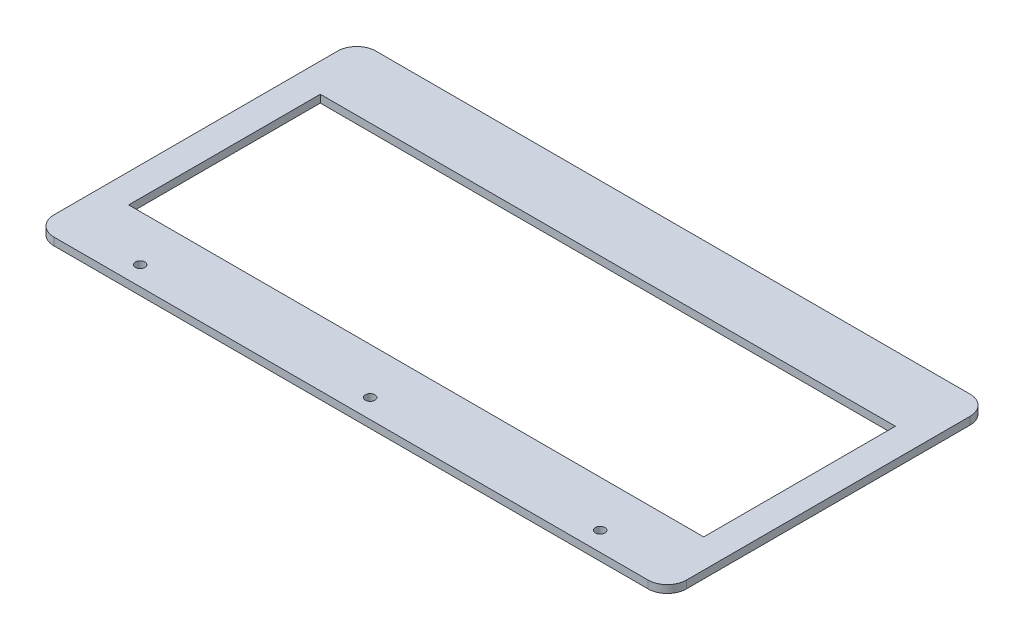
ISO-10303-21;
HEADER;
FILE_DESCRIPTION(('STEP AP214'),'2;1');
FILE_NAME('part.step','',(''),(''),'','','');
FILE_SCHEMA(('AUTOMOTIVE_DESIGN { 1 0 10303 214 1 1 1 1 }'));
ENDSEC;
DATA;
#1=APPLICATION_CONTEXT('core data for automotive mechanical design processes');
#2=APPLICATION_PROTOCOL_DEFINITION('international standard','automotive_design',2000,#1);
#3=PRODUCT_CONTEXT('',#1,'mechanical');
#4=PRODUCT('Part','Part','',(#3));
#5=PRODUCT_RELATED_PRODUCT_CATEGORY('part','',(#4));
#6=PRODUCT_DEFINITION_FORMATION('','',#4);
#7=PRODUCT_DEFINITION_CONTEXT('part definition',#1,'design');
#8=PRODUCT_DEFINITION('design','',#6,#7);
#9=PRODUCT_DEFINITION_SHAPE('','',#8);
#10=(LENGTH_UNIT() NAMED_UNIT(*) SI_UNIT(.MILLI.,.METRE.));
#11=(NAMED_UNIT(*) PLANE_ANGLE_UNIT() SI_UNIT($,.RADIAN.));
#12=(NAMED_UNIT(*) SI_UNIT($,.STERADIAN.) SOLID_ANGLE_UNIT());
#13=UNCERTAINTY_MEASURE_WITH_UNIT(LENGTH_MEASURE(1.E-05),#10,'distance_accuracy_value','');
#14=(GEOMETRIC_REPRESENTATION_CONTEXT(3) GLOBAL_UNCERTAINTY_ASSIGNED_CONTEXT((#13)) GLOBAL_UNIT_ASSIGNED_CONTEXT((#10,
#11,#12)) REPRESENTATION_CONTEXT('',''));
#15=CARTESIAN_POINT('',(0.,0.,0.));
#16=DIRECTION('',(0.,0.,1.));
#17=DIRECTION('',(1.,0.,0.));
#18=AXIS2_PLACEMENT_3D('',#15,#16,#17);
#19=CARTESIAN_POINT('',(-150.,-357.991093751232,-164.25));
#20=DIRECTION('',(0.,0.,-1.));
#21=DIRECTION('',(-1.,0.,0.));
#22=AXIS2_PLACEMENT_3D('',#19,#20,#21);
#23=PLANE('',#22);
#24=DIRECTION('',(0.,1.,0.));
#25=VECTOR('',#24,1.);
#26=CARTESIAN_POINT('',(150.,-357.991093751232,-164.25));
#27=LINE('',#26,#25);
#28=CARTESIAN_POINT('',(150.,-361.991093751232,-164.25));
#29=VERTEX_POINT('',#28);
#30=CARTESIAN_POINT('',(150.,-357.991093751232,-164.25));
#31=VERTEX_POINT('',#30);
#32=EDGE_CURVE('E11',#29,#31,#27,.T.);
#33=ORIENTED_EDGE('',*,*,#32,.F.);
#34=DIRECTION('',(1.,0.,0.));
#35=VECTOR('',#34,1.);
#36=CARTESIAN_POINT('',(0.,-361.991093751232,-164.25));
#37=LINE('',#36,#35);
#38=CARTESIAN_POINT('',(-150.,-361.991093751232,-164.25));
#39=VERTEX_POINT('',#38);
#40=EDGE_CURVE('E116',#29,#39,#37,.F.);
#41=ORIENTED_EDGE('',*,*,#40,.T.);
#42=DIRECTION('',(0.,1.,0.));
#43=VECTOR('',#42,1.);
#44=CARTESIAN_POINT('',(-150.,-357.991093751232,-164.25));
#45=LINE('',#44,#43);
#46=CARTESIAN_POINT('',(-150.,-357.991093751232,-164.25));
#47=VERTEX_POINT('',#46);
#48=EDGE_CURVE('E47',#39,#47,#45,.T.);
#49=ORIENTED_EDGE('',*,*,#48,.T.);
#50=DIRECTION('',(-1.,0.,0.));
#51=VECTOR('',#50,1.);
#52=CARTESIAN_POINT('',(-150.,-357.991093751232,-164.25));
#53=LINE('',#52,#51);
#54=EDGE_CURVE('E158',#31,#47,#53,.T.);
#55=ORIENTED_EDGE('',*,*,#54,.F.);
#56=EDGE_LOOP('',(#33,#41,#49,#55));
#57=FACE_BOUND('',#56,.T.);
#58=ADVANCED_FACE('F37',(#57),#23,.T.);
#59=CARTESIAN_POINT('',(-150.,-357.991093751232,-164.25));
#60=DIRECTION('',(1.,0.,0.));
#61=DIRECTION('',(0.,0.,-1.));
#62=AXIS2_PLACEMENT_3D('',#59,#60,#61);
#63=PLANE('',#62);
#64=ORIENTED_EDGE('',*,*,#48,.F.);
#65=DIRECTION('',(0.,0.,1.));
#66=VECTOR('',#65,1.);
#67=CARTESIAN_POINT('',(-150.,-361.991093751232,0.));
#68=LINE('',#67,#66);
#69=CARTESIAN_POINT('',(-150.,-361.991093751232,-264.25));
#70=VERTEX_POINT('',#69);
#71=EDGE_CURVE('E128',#39,#70,#68,.F.);
#72=ORIENTED_EDGE('',*,*,#71,.T.);
#73=DIRECTION('',(0.,1.,0.));
#74=VECTOR('',#73,1.);
#75=CARTESIAN_POINT('',(-150.,-357.991093751232,-264.25));
#76=LINE('',#75,#74);
#77=CARTESIAN_POINT('',(-150.,-357.991093751232,-264.25));
#78=VERTEX_POINT('',#77);
#79=EDGE_CURVE('E55',#70,#78,#76,.T.);
#80=ORIENTED_EDGE('',*,*,#79,.T.);
#81=DIRECTION('',(0.,0.,-1.));
#82=VECTOR('',#81,1.);
#83=CARTESIAN_POINT('',(-150.,-357.991093751232,-164.25));
#84=LINE('',#83,#82);
#85=EDGE_CURVE('E155',#47,#78,#84,.T.);
#86=ORIENTED_EDGE('',*,*,#85,.F.);
#87=EDGE_LOOP('',(#64,#72,#80,#86));
#88=FACE_BOUND('',#87,.T.);
#89=ADVANCED_FACE('F163',(#88),#63,.T.);
#90=CARTESIAN_POINT('',(-150.,-357.991093751232,-264.25));
#91=DIRECTION('',(0.,0.,1.));
#92=DIRECTION('',(1.,0.,0.));
#93=AXIS2_PLACEMENT_3D('',#90,#91,#92);
#94=PLANE('',#93);
#95=ORIENTED_EDGE('',*,*,#79,.F.);
#96=DIRECTION('',(1.,0.,0.));
#97=VECTOR('',#96,1.);
#98=CARTESIAN_POINT('',(0.,-361.991093751232,-264.25));
#99=LINE('',#98,#97);
#100=CARTESIAN_POINT('',(150.,-361.991093751232,-264.25));
#101=VERTEX_POINT('',#100);
#102=EDGE_CURVE('E115',#70,#101,#99,.T.);
#103=ORIENTED_EDGE('',*,*,#102,.T.);
#104=DIRECTION('',(0.,1.,0.));
#105=VECTOR('',#104,1.);
#106=CARTESIAN_POINT('',(150.,-357.991093751232,-264.25));
#107=LINE('',#106,#105);
#108=CARTESIAN_POINT('',(150.,-357.991093751232,-264.25));
#109=VERTEX_POINT('',#108);
#110=EDGE_CURVE('E41',#101,#109,#107,.T.);
#111=ORIENTED_EDGE('',*,*,#110,.T.);
#112=DIRECTION('',(1.,0.,0.));
#113=VECTOR('',#112,1.);
#114=CARTESIAN_POINT('',(-150.,-357.991093751232,-264.25));
#115=LINE('',#114,#113);
#116=EDGE_CURVE('E255',#78,#109,#115,.T.);
#117=ORIENTED_EDGE('',*,*,#116,.F.);
#118=EDGE_LOOP('',(#95,#103,#111,#117));
#119=FACE_BOUND('',#118,.T.);
#120=ADVANCED_FACE('F118',(#119),#94,.T.);
#121=CARTESIAN_POINT('',(-165.,-357.991093751232,-298.25));
#122=DIRECTION('',(0.,0.,1.));
#123=DIRECTION('',(1.,0.,0.));
#124=AXIS2_PLACEMENT_3D('',#121,#122,#123);
#125=PLANE('',#124);
#126=DIRECTION('',(0.,1.,0.));
#127=VECTOR('',#126,1.);
#128=CARTESIAN_POINT('',(155.,-357.991093751232,-298.25));
#129=LINE('',#128,#127);
#130=CARTESIAN_POINT('',(155.,-361.991093751232,-298.25));
#131=VERTEX_POINT('',#130);
#132=CARTESIAN_POINT('',(155.,-357.991093751232,-298.25));
#133=VERTEX_POINT('',#132);
#134=EDGE_CURVE('E110',#131,#133,#129,.T.);
#135=ORIENTED_EDGE('',*,*,#134,.F.);
#136=DIRECTION('',(1.,0.,0.));
#137=VECTOR('',#136,1.);
#138=CARTESIAN_POINT('',(0.,-361.991093751232,-298.25));
#139=LINE('',#138,#137);
#140=CARTESIAN_POINT('',(-155.,-361.991093751232,-298.25));
#141=VERTEX_POINT('',#140);
#142=EDGE_CURVE('E189',#141,#131,#139,.T.);
#143=ORIENTED_EDGE('',*,*,#142,.F.);
#144=DIRECTION('',(0.,1.,0.));
#145=VECTOR('',#144,1.);
#146=CARTESIAN_POINT('',(-155.,-357.991093751232,-298.25));
#147=LINE('',#146,#145);
#148=CARTESIAN_POINT('',(-155.,-357.991093751232,-298.25));
#149=VERTEX_POINT('',#148);
#150=EDGE_CURVE('E148',#141,#149,#147,.T.);
#151=ORIENTED_EDGE('',*,*,#150,.T.);
#152=DIRECTION('',(1.,0.,0.));
#153=VECTOR('',#152,1.);
#154=CARTESIAN_POINT('',(-165.,-357.991093751232,-298.25));
#155=LINE('',#154,#153);
#156=EDGE_CURVE('E232',#149,#133,#155,.T.);
#157=ORIENTED_EDGE('',*,*,#156,.T.);
#158=EDGE_LOOP('',(#135,#143,#151,#157));
#159=FACE_BOUND('',#158,.T.);
#160=ADVANCED_FACE('F231',(#159),#125,.F.);
#161=CARTESIAN_POINT('',(-155.,-357.991093751232,-288.25));
#162=DIRECTION('',(0.,1.,0.));
#163=DIRECTION('',(0.,0.,1.));
#164=AXIS2_PLACEMENT_3D('',#161,#162,#163);
#165=CYLINDRICAL_SURFACE('',#164,10.);
#166=ORIENTED_EDGE('',*,*,#150,.F.);
#167=CARTESIAN_POINT('',(-155.,-361.991093751232,-288.25));
#168=DIRECTION('',(0.,1.,0.));
#169=DIRECTION('',(0.,0.,1.));
#170=AXIS2_PLACEMENT_3D('',#167,#168,#169);
#171=CIRCLE('',#170,10.);
#172=CARTESIAN_POINT('',(-165.,-361.991093751232,-288.25));
#173=VERTEX_POINT('',#172);
#174=EDGE_CURVE('E187',#141,#173,#171,.T.);
#175=ORIENTED_EDGE('',*,*,#174,.T.);
#176=DIRECTION('',(0.,1.,0.));
#177=VECTOR('',#176,1.);
#178=CARTESIAN_POINT('',(-165.,-357.991093751232,-288.25));
#179=LINE('',#178,#177);
#180=CARTESIAN_POINT('',(-165.,-357.991093751232,-288.25));
#181=VERTEX_POINT('',#180);
#182=EDGE_CURVE('E145',#173,#181,#179,.T.);
#183=ORIENTED_EDGE('',*,*,#182,.T.);
#184=CARTESIAN_POINT('',(-155.,-357.991093751232,-288.25));
#185=DIRECTION('',(0.,1.,0.));
#186=DIRECTION('',(0.,0.,1.));
#187=AXIS2_PLACEMENT_3D('',#184,#185,#186);
#188=CIRCLE('',#187,10.);
#189=EDGE_CURVE('E238',#149,#181,#188,.T.);
#190=ORIENTED_EDGE('',*,*,#189,.F.);
#191=EDGE_LOOP('',(#166,#175,#183,#190));
#192=FACE_BOUND('',#191,.T.);
#193=ADVANCED_FACE('F242',(#192),#165,.T.);
#194=CARTESIAN_POINT('',(-165.,-357.991093751232,-298.25));
#195=DIRECTION('',(1.,0.,0.));
#196=DIRECTION('',(0.,0.,-1.));
#197=AXIS2_PLACEMENT_3D('',#194,#195,#196);
#198=PLANE('',#197);
#199=ORIENTED_EDGE('',*,*,#182,.F.);
#200=DIRECTION('',(0.,0.,1.));
#201=VECTOR('',#200,1.);
#202=CARTESIAN_POINT('',(-165.,-361.991093751232,0.));
#203=LINE('',#202,#201);
#204=CARTESIAN_POINT('',(-165.,-361.991093751232,-140.25));
#205=VERTEX_POINT('',#204);
#206=EDGE_CURVE('E184',#205,#173,#203,.F.);
#207=ORIENTED_EDGE('',*,*,#206,.F.);
#208=DIRECTION('',(0.,1.,0.));
#209=VECTOR('',#208,1.);
#210=CARTESIAN_POINT('',(-165.,-357.991093751232,-140.25));
#211=LINE('',#210,#209);
#212=CARTESIAN_POINT('',(-165.,-357.991093751232,-140.25));
#213=VERTEX_POINT('',#212);
#214=EDGE_CURVE('E142',#205,#213,#211,.T.);
#215=ORIENTED_EDGE('',*,*,#214,.T.);
#216=DIRECTION('',(0.,0.,-1.));
#217=VECTOR('',#216,1.);
#218=CARTESIAN_POINT('',(-165.,-357.991093751232,-298.25));
#219=LINE('',#218,#217);
#220=EDGE_CURVE('E243',#213,#181,#219,.T.);
#221=ORIENTED_EDGE('',*,*,#220,.T.);
#222=EDGE_LOOP('',(#199,#207,#215,#221));
#223=FACE_BOUND('',#222,.T.);
#224=ADVANCED_FACE('F266',(#223),#198,.F.);
#225=CARTESIAN_POINT('',(-155.,-357.991093751232,-140.25));
#226=DIRECTION('',(0.,1.,0.));
#227=DIRECTION('',(0.,0.,1.));
#228=AXIS2_PLACEMENT_3D('',#225,#226,#227);
#229=CYLINDRICAL_SURFACE('',#228,10.);
#230=ORIENTED_EDGE('',*,*,#214,.F.);
#231=CARTESIAN_POINT('',(-155.,-361.991093751232,-140.25));
#232=DIRECTION('',(0.,1.,0.));
#233=DIRECTION('',(0.,0.,1.));
#234=AXIS2_PLACEMENT_3D('',#231,#232,#233);
#235=CIRCLE('',#234,10.);
#236=CARTESIAN_POINT('',(-155.,-361.991093751232,-130.25));
#237=VERTEX_POINT('',#236);
#238=EDGE_CURVE('E181',#205,#237,#235,.T.);
#239=ORIENTED_EDGE('',*,*,#238,.T.);
#240=DIRECTION('',(0.,1.,0.));
#241=VECTOR('',#240,1.);
#242=CARTESIAN_POINT('',(-155.,-357.991093751232,-130.25));
#243=LINE('',#242,#241);
#244=CARTESIAN_POINT('',(-155.,-357.991093751232,-130.25));
#245=VERTEX_POINT('',#244);
#246=EDGE_CURVE('E139',#237,#245,#243,.T.);
#247=ORIENTED_EDGE('',*,*,#246,.T.);
#248=CARTESIAN_POINT('',(-155.,-357.991093751232,-140.25));
#249=DIRECTION('',(0.,1.,0.));
#250=DIRECTION('',(0.,0.,1.));
#251=AXIS2_PLACEMENT_3D('',#248,#249,#250);
#252=CIRCLE('',#251,10.);
#253=EDGE_CURVE('E245',#213,#245,#252,.T.);
#254=ORIENTED_EDGE('',*,*,#253,.F.);
#255=EDGE_LOOP('',(#230,#239,#247,#254));
#256=FACE_BOUND('',#255,.T.);
#257=ADVANCED_FACE('F264',(#256),#229,.T.);
#258=CARTESIAN_POINT('',(-165.,-357.991093751232,-130.25));
#259=DIRECTION('',(0.,0.,-1.));
#260=DIRECTION('',(-1.,0.,0.));
#261=AXIS2_PLACEMENT_3D('',#258,#259,#260);
#262=PLANE('',#261);
#263=ORIENTED_EDGE('',*,*,#246,.F.);
#264=DIRECTION('',(1.,0.,0.));
#265=VECTOR('',#264,1.);
#266=CARTESIAN_POINT('',(0.,-361.991093751232,-130.25));
#267=LINE('',#266,#265);
#268=CARTESIAN_POINT('',(155.,-361.991093751232,-130.25));
#269=VERTEX_POINT('',#268);
#270=EDGE_CURVE('E122',#269,#237,#267,.F.);
#271=ORIENTED_EDGE('',*,*,#270,.F.);
#272=DIRECTION('',(0.,1.,0.));
#273=VECTOR('',#272,1.);
#274=CARTESIAN_POINT('',(155.,-357.991093751232,-130.25));
#275=LINE('',#274,#273);
#276=CARTESIAN_POINT('',(155.,-357.991093751232,-130.25));
#277=VERTEX_POINT('',#276);
#278=EDGE_CURVE('E135',#269,#277,#275,.T.);
#279=ORIENTED_EDGE('',*,*,#278,.T.);
#280=DIRECTION('',(-1.,0.,0.));
#281=VECTOR('',#280,1.);
#282=CARTESIAN_POINT('',(-165.,-357.991093751232,-130.25));
#283=LINE('',#282,#281);
#284=EDGE_CURVE('E251',#277,#245,#283,.T.);
#285=ORIENTED_EDGE('',*,*,#284,.T.);
#286=EDGE_LOOP('',(#263,#271,#279,#285));
#287=FACE_BOUND('',#286,.T.);
#288=ADVANCED_FACE('F259',(#287),#262,.F.);
#289=CARTESIAN_POINT('',(155.,-357.991093751232,-140.25));
#290=DIRECTION('',(0.,1.,0.));
#291=DIRECTION('',(0.,0.,1.));
#292=AXIS2_PLACEMENT_3D('',#289,#290,#291);
#293=CYLINDRICAL_SURFACE('',#292,10.);
#294=ORIENTED_EDGE('',*,*,#278,.F.);
#295=CARTESIAN_POINT('',(155.,-361.991093751232,-140.25));
#296=DIRECTION('',(0.,1.,0.));
#297=DIRECTION('',(0.,0.,1.));
#298=AXIS2_PLACEMENT_3D('',#295,#296,#297);
#299=CIRCLE('',#298,10.);
#300=CARTESIAN_POINT('',(165.,-361.991093751232,-140.25));
#301=VERTEX_POINT('',#300);
#302=EDGE_CURVE('E119',#269,#301,#299,.T.);
#303=ORIENTED_EDGE('',*,*,#302,.T.);
#304=DIRECTION('',(0.,1.,0.));
#305=VECTOR('',#304,1.);
#306=CARTESIAN_POINT('',(165.,-357.991093751232,-140.25));
#307=LINE('',#306,#305);
#308=CARTESIAN_POINT('',(165.,-357.991093751232,-140.25));
#309=VERTEX_POINT('',#308);
#310=EDGE_CURVE('E132',#301,#309,#307,.T.);
#311=ORIENTED_EDGE('',*,*,#310,.T.);
#312=CARTESIAN_POINT('',(155.,-357.991093751232,-140.25));
#313=DIRECTION('',(0.,1.,0.));
#314=DIRECTION('',(0.,0.,1.));
#315=AXIS2_PLACEMENT_3D('',#312,#313,#314);
#316=CIRCLE('',#315,10.);
#317=EDGE_CURVE('E214',#277,#309,#316,.T.);
#318=ORIENTED_EDGE('',*,*,#317,.F.);
#319=EDGE_LOOP('',(#294,#303,#311,#318));
#320=FACE_BOUND('',#319,.T.);
#321=ADVANCED_FACE('F212',(#320),#293,.T.);
#322=CARTESIAN_POINT('',(165.,-357.991093751232,-298.25));
#323=DIRECTION('',(-1.,0.,0.));
#324=DIRECTION('',(0.,0.,1.));
#325=AXIS2_PLACEMENT_3D('',#322,#323,#324);
#326=PLANE('',#325);
#327=ORIENTED_EDGE('',*,*,#310,.F.);
#328=DIRECTION('',(0.,0.,1.));
#329=VECTOR('',#328,1.);
#330=CARTESIAN_POINT('',(165.,-361.991093751232,0.));
#331=LINE('',#330,#329);
#332=CARTESIAN_POINT('',(165.,-361.991093751232,-288.25));
#333=VERTEX_POINT('',#332);
#334=EDGE_CURVE('E176',#333,#301,#331,.T.);
#335=ORIENTED_EDGE('',*,*,#334,.F.);
#336=DIRECTION('',(0.,1.,0.));
#337=VECTOR('',#336,1.);
#338=CARTESIAN_POINT('',(165.,-357.991093751232,-288.25));
#339=LINE('',#338,#337);
#340=CARTESIAN_POINT('',(165.,-357.991093751232,-288.25));
#341=VERTEX_POINT('',#340);
#342=EDGE_CURVE('E136',#333,#341,#339,.T.);
#343=ORIENTED_EDGE('',*,*,#342,.T.);
#344=DIRECTION('',(0.,0.,1.));
#345=VECTOR('',#344,1.);
#346=CARTESIAN_POINT('',(165.,-357.991093751232,-298.25));
#347=LINE('',#346,#345);
#348=EDGE_CURVE('E208',#341,#309,#347,.T.);
#349=ORIENTED_EDGE('',*,*,#348,.T.);
#350=EDGE_LOOP('',(#327,#335,#343,#349));
#351=FACE_BOUND('',#350,.T.);
#352=ADVANCED_FACE('F204',(#351),#326,.F.);
#353=CARTESIAN_POINT('',(-120.,-357.991093751232,-140.25));
#354=DIRECTION('',(0.,1.,0.));
#355=DIRECTION('',(0.,0.,1.));
#356=AXIS2_PLACEMENT_3D('',#353,#354,#355);
#357=CYLINDRICAL_SURFACE('',#356,2.49999999999999);
#358=CARTESIAN_POINT('',(-120.,-357.991093751232,-140.25));
#359=DIRECTION('',(0.,1.,0.));
#360=DIRECTION('',(0.,0.,1.));
#361=AXIS2_PLACEMENT_3D('',#358,#359,#360);
#362=CIRCLE('',#361,2.49999999999999);
#363=CARTESIAN_POINT('',(-120.,-357.991093751232,-137.75));
#364=VERTEX_POINT('',#363);
#365=EDGE_CURVE('E130',#364,#364,#362,.T.);
#366=ORIENTED_EDGE('',*,*,#365,.T.);
#367=EDGE_LOOP('',(#366));
#368=FACE_BOUND('',#367,.T.);
#369=CARTESIAN_POINT('',(-120.,-361.991093751232,-140.25));
#370=DIRECTION('',(0.,1.,0.));
#371=DIRECTION('',(0.,0.,1.));
#372=AXIS2_PLACEMENT_3D('',#369,#370,#371);
#373=CIRCLE('',#372,2.49999999999999);
#374=CARTESIAN_POINT('',(-120.,-361.991093751232,-137.75));
#375=VERTEX_POINT('',#374);
#376=EDGE_CURVE('E167',#375,#375,#373,.T.);
#377=ORIENTED_EDGE('',*,*,#376,.F.);
#378=EDGE_LOOP('',(#377));
#379=FACE_BOUND('',#378,.T.);
#380=ADVANCED_FACE('F335',(#368,#379),#357,.F.);
#381=CARTESIAN_POINT('',(0.,-357.991093751232,-140.25));
#382=DIRECTION('',(0.,1.,0.));
#383=DIRECTION('',(0.,0.,1.));
#384=AXIS2_PLACEMENT_3D('',#381,#382,#383);
#385=CYLINDRICAL_SURFACE('',#384,2.49999999999999);
#386=CARTESIAN_POINT('',(0.,-357.991093751232,-140.25));
#387=DIRECTION('',(0.,1.,0.));
#388=DIRECTION('',(0.,0.,1.));
#389=AXIS2_PLACEMENT_3D('',#386,#387,#388);
#390=CIRCLE('',#389,2.49999999999999);
#391=CARTESIAN_POINT('',(0.,-357.991093751232,-137.75));
#392=VERTEX_POINT('',#391);
#393=EDGE_CURVE('E494',#392,#392,#390,.T.);
#394=ORIENTED_EDGE('',*,*,#393,.T.);
#395=EDGE_LOOP('',(#394));
#396=FACE_BOUND('',#395,.T.);
#397=CARTESIAN_POINT('',(0.,-361.991093751232,-140.25));
#398=DIRECTION('',(0.,1.,0.));
#399=DIRECTION('',(0.,0.,1.));
#400=AXIS2_PLACEMENT_3D('',#397,#398,#399);
#401=CIRCLE('',#400,2.49999999999999);
#402=CARTESIAN_POINT('',(0.,-361.991093751232,-137.75));
#403=VERTEX_POINT('',#402);
#404=EDGE_CURVE('E170',#403,#403,#401,.T.);
#405=ORIENTED_EDGE('',*,*,#404,.F.);
#406=EDGE_LOOP('',(#405));
#407=FACE_BOUND('',#406,.T.);
#408=ADVANCED_FACE('F345',(#396,#407),#385,.F.);
#409=CARTESIAN_POINT('',(120.,-357.991093751232,-140.25));
#410=DIRECTION('',(0.,1.,0.));
#411=DIRECTION('',(0.,0.,1.));
#412=AXIS2_PLACEMENT_3D('',#409,#410,#411);
#413=CYLINDRICAL_SURFACE('',#412,2.49999999999999);
#414=CARTESIAN_POINT('',(120.,-357.991093751232,-140.25));
#415=DIRECTION('',(0.,1.,0.));
#416=DIRECTION('',(0.,0.,1.));
#417=AXIS2_PLACEMENT_3D('',#414,#415,#416);
#418=CIRCLE('',#417,2.49999999999999);
#419=CARTESIAN_POINT('',(120.,-357.991093751232,-137.75));
#420=VERTEX_POINT('',#419);
#421=EDGE_CURVE('E497',#420,#420,#418,.T.);
#422=ORIENTED_EDGE('',*,*,#421,.T.);
#423=EDGE_LOOP('',(#422));
#424=FACE_BOUND('',#423,.T.);
#425=CARTESIAN_POINT('',(120.,-361.991093751232,-140.25));
#426=DIRECTION('',(0.,1.,0.));
#427=DIRECTION('',(0.,0.,1.));
#428=AXIS2_PLACEMENT_3D('',#425,#426,#427);
#429=CIRCLE('',#428,2.49999999999999);
#430=CARTESIAN_POINT('',(120.,-361.991093751232,-137.75));
#431=VERTEX_POINT('',#430);
#432=EDGE_CURVE('E173',#431,#431,#429,.T.);
#433=ORIENTED_EDGE('',*,*,#432,.F.);
#434=EDGE_LOOP('',(#433));
#435=FACE_BOUND('',#434,.T.);
#436=ADVANCED_FACE('F285',(#424,#435),#413,.F.);
#437=CARTESIAN_POINT('',(155.,-357.991093751232,-288.25));
#438=DIRECTION('',(0.,1.,0.));
#439=DIRECTION('',(0.,0.,1.));
#440=AXIS2_PLACEMENT_3D('',#437,#438,#439);
#441=CYLINDRICAL_SURFACE('',#440,10.);
#442=CARTESIAN_POINT('',(155.,-361.991093751232,-288.25));
#443=DIRECTION('',(0.,1.,0.));
#444=DIRECTION('',(0.,0.,1.));
#445=AXIS2_PLACEMENT_3D('',#442,#443,#444);
#446=CIRCLE('',#445,10.);
#447=EDGE_CURVE('E126',#333,#131,#446,.T.);
#448=ORIENTED_EDGE('',*,*,#447,.T.);
#449=ORIENTED_EDGE('',*,*,#134,.T.);
#450=CARTESIAN_POINT('',(155.,-357.991093751232,-288.25));
#451=DIRECTION('',(0.,1.,0.));
#452=DIRECTION('',(0.,0.,1.));
#453=AXIS2_PLACEMENT_3D('',#450,#451,#452);
#454=CIRCLE('',#453,10.);
#455=EDGE_CURVE('E240',#341,#133,#454,.T.);
#456=ORIENTED_EDGE('',*,*,#455,.F.);
#457=ORIENTED_EDGE('',*,*,#342,.F.);
#458=EDGE_LOOP('',(#448,#449,#456,#457));
#459=FACE_BOUND('',#458,.T.);
#460=ADVANCED_FACE('F197',(#459),#441,.T.);
#461=CARTESIAN_POINT('',(150.,-357.991093751232,-164.25));
#462=DIRECTION('',(-1.,0.,0.));
#463=DIRECTION('',(0.,0.,1.));
#464=AXIS2_PLACEMENT_3D('',#461,#462,#463);
#465=PLANE('',#464);
#466=DIRECTION('',(0.,0.,1.));
#467=VECTOR('',#466,1.);
#468=CARTESIAN_POINT('',(150.,-361.991093751232,0.));
#469=LINE('',#468,#467);
#470=EDGE_CURVE('E103',#101,#29,#469,.T.);
#471=ORIENTED_EDGE('',*,*,#470,.T.);
#472=ORIENTED_EDGE('',*,*,#32,.T.);
#473=DIRECTION('',(0.,0.,1.));
#474=VECTOR('',#473,1.);
#475=CARTESIAN_POINT('',(150.,-357.991093751232,-164.25));
#476=LINE('',#475,#474);
#477=EDGE_CURVE('E106',#109,#31,#476,.T.);
#478=ORIENTED_EDGE('',*,*,#477,.F.);
#479=ORIENTED_EDGE('',*,*,#110,.F.);
#480=EDGE_LOOP('',(#471,#472,#478,#479));
#481=FACE_BOUND('',#480,.T.);
#482=ADVANCED_FACE('F39',(#481),#465,.T.);
#483=CARTESIAN_POINT('',(0.,-357.991093751232,0.));
#484=DIRECTION('',(0.,1.,0.));
#485=DIRECTION('',(0.,0.,1.));
#486=AXIS2_PLACEMENT_3D('',#483,#484,#485);
#487=PLANE('',#486);
#488=ORIENTED_EDGE('',*,*,#365,.F.);
#489=EDGE_LOOP('',(#488));
#490=FACE_BOUND('',#489,.T.);
#491=ORIENTED_EDGE('',*,*,#393,.F.);
#492=EDGE_LOOP('',(#491));
#493=FACE_BOUND('',#492,.T.);
#494=ORIENTED_EDGE('',*,*,#421,.F.);
#495=EDGE_LOOP('',(#494));
#496=FACE_BOUND('',#495,.T.);
#497=ORIENTED_EDGE('',*,*,#348,.F.);
#498=ORIENTED_EDGE('',*,*,#455,.T.);
#499=ORIENTED_EDGE('',*,*,#156,.F.);
#500=ORIENTED_EDGE('',*,*,#189,.T.);
#501=ORIENTED_EDGE('',*,*,#220,.F.);
#502=ORIENTED_EDGE('',*,*,#253,.T.);
#503=ORIENTED_EDGE('',*,*,#284,.F.);
#504=ORIENTED_EDGE('',*,*,#317,.T.);
#505=EDGE_LOOP('',(#497,#498,#499,#500,#501,#502,#503,#504));
#506=FACE_BOUND('',#505,.T.);
#507=ORIENTED_EDGE('',*,*,#116,.T.);
#508=ORIENTED_EDGE('',*,*,#477,.T.);
#509=ORIENTED_EDGE('',*,*,#54,.T.);
#510=ORIENTED_EDGE('',*,*,#85,.T.);
#511=EDGE_LOOP('',(#507,#508,#509,#510));
#512=FACE_BOUND('',#511,.T.);
#513=ADVANCED_FACE('F161',(#490,#493,#496,#506,#512),#487,.T.);
#514=CARTESIAN_POINT('',(0.,-361.991093751232,0.));
#515=DIRECTION('',(0.,1.,0.));
#516=DIRECTION('',(0.,0.,1.));
#517=AXIS2_PLACEMENT_3D('',#514,#515,#516);
#518=PLANE('',#517);
#519=ORIENTED_EDGE('',*,*,#376,.T.);
#520=EDGE_LOOP('',(#519));
#521=FACE_BOUND('',#520,.T.);
#522=ORIENTED_EDGE('',*,*,#404,.T.);
#523=EDGE_LOOP('',(#522));
#524=FACE_BOUND('',#523,.T.);
#525=ORIENTED_EDGE('',*,*,#432,.T.);
#526=EDGE_LOOP('',(#525));
#527=FACE_BOUND('',#526,.T.);
#528=ORIENTED_EDGE('',*,*,#334,.T.);
#529=ORIENTED_EDGE('',*,*,#302,.F.);
#530=ORIENTED_EDGE('',*,*,#270,.T.);
#531=ORIENTED_EDGE('',*,*,#238,.F.);
#532=ORIENTED_EDGE('',*,*,#206,.T.);
#533=ORIENTED_EDGE('',*,*,#174,.F.);
#534=ORIENTED_EDGE('',*,*,#142,.T.);
#535=ORIENTED_EDGE('',*,*,#447,.F.);
#536=EDGE_LOOP('',(#528,#529,#530,#531,#532,#533,#534,#535));
#537=FACE_BOUND('',#536,.T.);
#538=ORIENTED_EDGE('',*,*,#102,.F.);
#539=ORIENTED_EDGE('',*,*,#71,.F.);
#540=ORIENTED_EDGE('',*,*,#40,.F.);
#541=ORIENTED_EDGE('',*,*,#470,.F.);
#542=EDGE_LOOP('',(#538,#539,#540,#541));
#543=FACE_BOUND('',#542,.T.);
#544=ADVANCED_FACE('F113',(#521,#524,#527,#537,#543),#518,.F.);
#545=CLOSED_SHELL('',(#58,#89,#120,#160,#193,#224,#257,#288,#321,#352,#380,#408,#436,#460,#482,
#513,#544));
#546=MANIFOLD_SOLID_BREP('B2',#545);
#547=ADVANCED_BREP_SHAPE_REPRESENTATION('',(#18,#546),#14);
#548=SHAPE_DEFINITION_REPRESENTATION(#9,#547);
ENDSEC;
END-ISO-10303-21;
